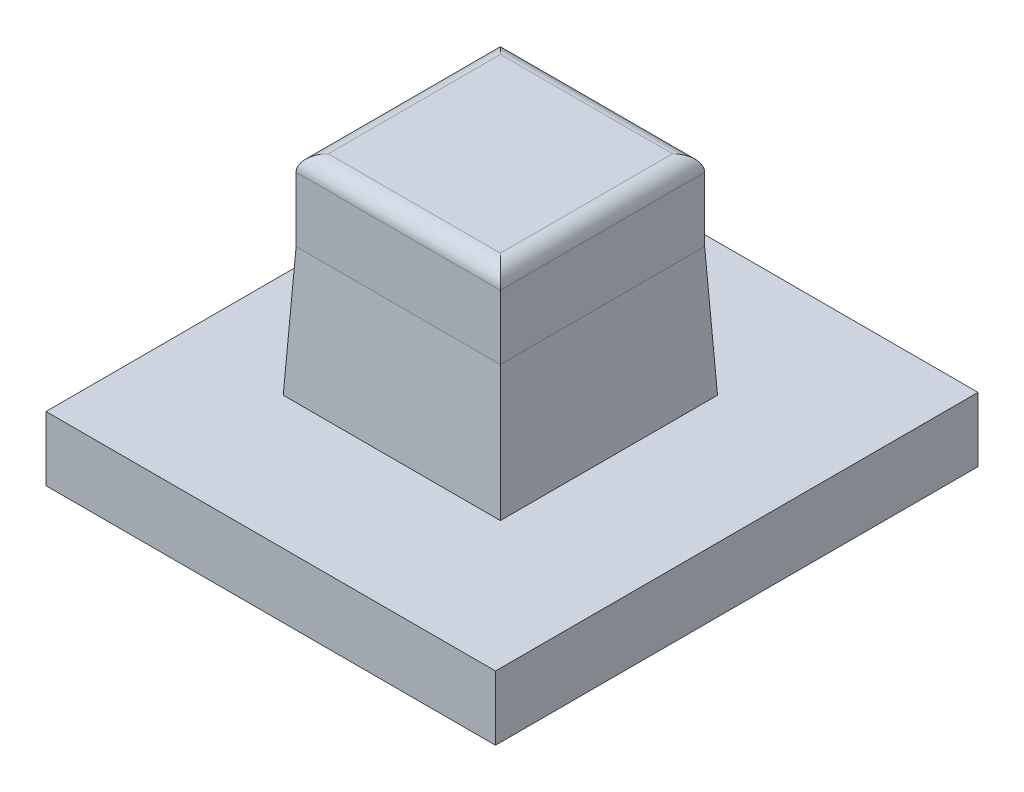
ISO-10303-21;
HEADER;
FILE_DESCRIPTION(('STEP AP214'),'2;1');
FILE_NAME('part.step','',(''),(''),'','','');
FILE_SCHEMA(('AUTOMOTIVE_DESIGN { 1 0 10303 214 1 1 1 1 }'));
ENDSEC;
DATA;
#1=APPLICATION_CONTEXT('core data for automotive mechanical design processes');
#2=APPLICATION_PROTOCOL_DEFINITION('international standard','automotive_design',2000,#1);
#3=PRODUCT_CONTEXT('',#1,'mechanical');
#4=PRODUCT('Part','Part','',(#3));
#5=PRODUCT_RELATED_PRODUCT_CATEGORY('part','',(#4));
#6=PRODUCT_DEFINITION_FORMATION('','',#4);
#7=PRODUCT_DEFINITION_CONTEXT('part definition',#1,'design');
#8=PRODUCT_DEFINITION('design','',#6,#7);
#9=PRODUCT_DEFINITION_SHAPE('','',#8);
#10=(LENGTH_UNIT() NAMED_UNIT(*) SI_UNIT(.MILLI.,.METRE.));
#11=(NAMED_UNIT(*) PLANE_ANGLE_UNIT() SI_UNIT($,.RADIAN.));
#12=(NAMED_UNIT(*) SI_UNIT($,.STERADIAN.) SOLID_ANGLE_UNIT());
#13=UNCERTAINTY_MEASURE_WITH_UNIT(LENGTH_MEASURE(1.E-05),#10,'distance_accuracy_value','');
#14=(GEOMETRIC_REPRESENTATION_CONTEXT(3) GLOBAL_UNCERTAINTY_ASSIGNED_CONTEXT((#13)) GLOBAL_UNIT_ASSIGNED_CONTEXT((#10,
#11,#12)) REPRESENTATION_CONTEXT('',''));
#15=CARTESIAN_POINT('',(0.,0.,0.));
#16=DIRECTION('',(0.,0.,1.));
#17=DIRECTION('',(1.,0.,0.));
#18=AXIS2_PLACEMENT_3D('',#15,#16,#17);
#19=CARTESIAN_POINT('',(0.,4.,0.));
#20=DIRECTION('',(0.,-1.,0.));
#21=DIRECTION('',(0.,0.,-1.));
#22=AXIS2_PLACEMENT_3D('',#19,#20,#21);
#23=PLANE('',#22);
#24=DIRECTION('',(1.,0.,0.));
#25=VECTOR('',#24,1.);
#26=CARTESIAN_POINT('',(0.,4.,-21.75));
#27=LINE('',#26,#25);
#28=CARTESIAN_POINT('',(6.5,4.,-21.75));
#29=VERTEX_POINT('',#28);
#30=CARTESIAN_POINT('',(20.,4.,-21.75));
#31=VERTEX_POINT('',#30);
#32=EDGE_CURVE('E237',#29,#31,#27,.T.);
#33=ORIENTED_EDGE('',*,*,#32,.T.);
#34=DIRECTION('',(0.,0.,1.));
#35=VECTOR('',#34,1.);
#36=CARTESIAN_POINT('',(20.,4.,0.));
#37=LINE('',#36,#35);
#38=CARTESIAN_POINT('',(20.,4.,-8.25));
#39=VERTEX_POINT('',#38);
#40=EDGE_CURVE('E240',#31,#39,#37,.T.);
#41=ORIENTED_EDGE('',*,*,#40,.T.);
#42=DIRECTION('',(-1.,0.,0.));
#43=VECTOR('',#42,1.);
#44=CARTESIAN_POINT('',(0.,4.,-8.25));
#45=LINE('',#44,#43);
#46=CARTESIAN_POINT('',(6.5,4.,-8.25));
#47=VERTEX_POINT('',#46);
#48=EDGE_CURVE('E231',#39,#47,#45,.T.);
#49=ORIENTED_EDGE('',*,*,#48,.T.);
#50=DIRECTION('',(0.,0.,-1.));
#51=VECTOR('',#50,1.);
#52=CARTESIAN_POINT('',(6.5,4.,0.));
#53=LINE('',#52,#51);
#54=EDGE_CURVE('E234',#47,#29,#53,.T.);
#55=ORIENTED_EDGE('',*,*,#54,.T.);
#56=EDGE_LOOP('',(#33,#41,#49,#55));
#57=FACE_BOUND('',#56,.T.);
#58=DIRECTION('',(1.,0.,0.));
#59=VECTOR('',#58,1.);
#60=CARTESIAN_POINT('',(0.,4.,0.));
#61=LINE('',#60,#59);
#62=CARTESIAN_POINT('',(0.,4.,0.));
#63=VERTEX_POINT('',#62);
#64=CARTESIAN_POINT('',(27.9456453711945,4.,0.));
#65=VERTEX_POINT('',#64);
#66=EDGE_CURVE('E296',#63,#65,#61,.T.);
#67=ORIENTED_EDGE('',*,*,#66,.T.);
#68=DIRECTION('',(0.,0.,-1.));
#69=VECTOR('',#68,1.);
#70=CARTESIAN_POINT('',(27.9456453711945,4.,0.));
#71=LINE('',#70,#69);
#72=CARTESIAN_POINT('',(27.9456453711945,4.,-30.));
#73=VERTEX_POINT('',#72);
#74=EDGE_CURVE('E142',#65,#73,#71,.T.);
#75=ORIENTED_EDGE('',*,*,#74,.T.);
#76=DIRECTION('',(-1.,0.,0.));
#77=VECTOR('',#76,1.);
#78=CARTESIAN_POINT('',(0.,4.,-30.));
#79=LINE('',#78,#77);
#80=CARTESIAN_POINT('',(0.,4.,-30.));
#81=VERTEX_POINT('',#80);
#82=EDGE_CURVE('E178',#73,#81,#79,.T.);
#83=ORIENTED_EDGE('',*,*,#82,.T.);
#84=DIRECTION('',(0.,0.,1.));
#85=VECTOR('',#84,1.);
#86=CARTESIAN_POINT('',(0.,4.,0.));
#87=LINE('',#86,#85);
#88=EDGE_CURVE('E168',#81,#63,#87,.T.);
#89=ORIENTED_EDGE('',*,*,#88,.T.);
#90=EDGE_LOOP('',(#67,#75,#83,#89));
#91=FACE_BOUND('',#90,.T.);
#92=ADVANCED_FACE('F45',(#57,#91),#23,.F.);
#93=CARTESIAN_POINT('',(0.,0.,0.));
#94=DIRECTION('',(0.,-1.,0.));
#95=DIRECTION('',(0.,0.,-1.));
#96=AXIS2_PLACEMENT_3D('',#93,#94,#95);
#97=PLANE('',#96);
#98=DIRECTION('',(0.,0.,1.));
#99=VECTOR('',#98,1.);
#100=CARTESIAN_POINT('',(27.9456453711945,0.,-58.4020531329729));
#101=LINE('',#100,#99);
#102=CARTESIAN_POINT('',(27.9456453711945,0.,-30.));
#103=VERTEX_POINT('',#102);
#104=CARTESIAN_POINT('',(27.9456453711945,0.,0.));
#105=VERTEX_POINT('',#104);
#106=EDGE_CURVE('E139',#103,#105,#101,.T.);
#107=ORIENTED_EDGE('',*,*,#106,.T.);
#108=DIRECTION('',(1.,0.,0.));
#109=VECTOR('',#108,1.);
#110=CARTESIAN_POINT('',(0.,0.,0.));
#111=LINE('',#110,#109);
#112=CARTESIAN_POINT('',(0.,0.,0.));
#113=VERTEX_POINT('',#112);
#114=EDGE_CURVE('E153',#113,#105,#111,.T.);
#115=ORIENTED_EDGE('',*,*,#114,.F.);
#116=DIRECTION('',(0.,0.,1.));
#117=VECTOR('',#116,1.);
#118=CARTESIAN_POINT('',(0.,0.,0.));
#119=LINE('',#118,#117);
#120=CARTESIAN_POINT('',(0.,0.,-30.));
#121=VERTEX_POINT('',#120);
#122=EDGE_CURVE('E164',#121,#113,#119,.T.);
#123=ORIENTED_EDGE('',*,*,#122,.F.);
#124=DIRECTION('',(-1.,0.,0.));
#125=VECTOR('',#124,1.);
#126=CARTESIAN_POINT('',(0.,0.,-30.));
#127=LINE('',#126,#125);
#128=EDGE_CURVE('E155',#103,#121,#127,.T.);
#129=ORIENTED_EDGE('',*,*,#128,.F.);
#130=EDGE_LOOP('',(#107,#115,#123,#129));
#131=FACE_BOUND('',#130,.T.);
#132=ADVANCED_FACE('F151',(#131),#97,.T.);
#133=CARTESIAN_POINT('',(0.,4.,0.));
#134=DIRECTION('',(1.,0.,0.));
#135=DIRECTION('',(0.,0.,-1.));
#136=AXIS2_PLACEMENT_3D('',#133,#134,#135);
#137=PLANE('',#136);
#138=ORIENTED_EDGE('',*,*,#122,.T.);
#139=DIRECTION('',(0.,-1.,0.));
#140=VECTOR('',#139,1.);
#141=CARTESIAN_POINT('',(0.,4.,0.));
#142=LINE('',#141,#140);
#143=EDGE_CURVE('E161',#63,#113,#142,.T.);
#144=ORIENTED_EDGE('',*,*,#143,.F.);
#145=ORIENTED_EDGE('',*,*,#88,.F.);
#146=DIRECTION('',(0.,-1.,0.));
#147=VECTOR('',#146,1.);
#148=CARTESIAN_POINT('',(0.,4.,-30.));
#149=LINE('',#148,#147);
#150=EDGE_CURVE('E174',#81,#121,#149,.T.);
#151=ORIENTED_EDGE('',*,*,#150,.T.);
#152=EDGE_LOOP('',(#138,#144,#145,#151));
#153=FACE_BOUND('',#152,.T.);
#154=ADVANCED_FACE('F305',(#153),#137,.F.);
#155=CARTESIAN_POINT('',(0.,4.,0.));
#156=DIRECTION('',(0.,0.,-1.));
#157=DIRECTION('',(-1.,0.,0.));
#158=AXIS2_PLACEMENT_3D('',#155,#156,#157);
#159=PLANE('',#158);
#160=ORIENTED_EDGE('',*,*,#114,.T.);
#161=DIRECTION('',(0.,1.,0.));
#162=VECTOR('',#161,1.);
#163=CARTESIAN_POINT('',(27.9456453711945,4.,0.));
#164=LINE('',#163,#162);
#165=EDGE_CURVE('E136',#105,#65,#164,.T.);
#166=ORIENTED_EDGE('',*,*,#165,.T.);
#167=ORIENTED_EDGE('',*,*,#66,.F.);
#168=ORIENTED_EDGE('',*,*,#143,.T.);
#169=EDGE_LOOP('',(#160,#166,#167,#168));
#170=FACE_BOUND('',#169,.T.);
#171=ADVANCED_FACE('F159',(#170),#159,.F.);
#172=CARTESIAN_POINT('',(0.,4.,-30.));
#173=DIRECTION('',(0.,0.,1.));
#174=DIRECTION('',(1.,0.,0.));
#175=AXIS2_PLACEMENT_3D('',#172,#173,#174);
#176=PLANE('',#175);
#177=ORIENTED_EDGE('',*,*,#82,.F.);
#178=DIRECTION('',(0.,-1.,0.));
#179=VECTOR('',#178,1.);
#180=CARTESIAN_POINT('',(27.9456453711945,4.,-30.));
#181=LINE('',#180,#179);
#182=EDGE_CURVE('E181',#73,#103,#181,.T.);
#183=ORIENTED_EDGE('',*,*,#182,.T.);
#184=ORIENTED_EDGE('',*,*,#128,.T.);
#185=ORIENTED_EDGE('',*,*,#150,.F.);
#186=EDGE_LOOP('',(#177,#183,#184,#185));
#187=FACE_BOUND('',#186,.T.);
#188=ADVANCED_FACE('F303',(#187),#176,.F.);
#189=CARTESIAN_POINT('',(6.9,-17.9605122421383,-8.65));
#190=DIRECTION('',(0.,0.,1.));
#191=DIRECTION('',(1.,0.,0.));
#192=AXIS2_PLACEMENT_3D('',#189,#190,#191);
#193=PLANE('',#192);
#194=DIRECTION('',(0.,1.,0.));
#195=VECTOR('',#194,1.);
#196=CARTESIAN_POINT('',(6.9,-17.9605122421383,-8.65));
#197=LINE('',#196,#195);
#198=CARTESIAN_POINT('',(6.9,11.9999999999994,-8.65));
#199=VERTEX_POINT('',#198);
#200=CARTESIAN_POINT('',(6.9,16.,-8.65));
#201=VERTEX_POINT('',#200);
#202=EDGE_CURVE('E170',#199,#201,#197,.T.);
#203=ORIENTED_EDGE('',*,*,#202,.F.);
#204=DIRECTION('',(1.,0.,0.));
#205=VECTOR('',#204,1.);
#206=CARTESIAN_POINT('',(6.9,11.9999999999994,-8.65));
#207=LINE('',#206,#205);
#208=CARTESIAN_POINT('',(19.6,11.9999999999994,-8.65));
#209=VERTEX_POINT('',#208);
#210=EDGE_CURVE('E11',#199,#209,#207,.T.);
#211=ORIENTED_EDGE('',*,*,#210,.T.);
#212=DIRECTION('',(0.,1.,0.));
#213=VECTOR('',#212,1.);
#214=CARTESIAN_POINT('',(19.6,-17.9605122421383,-8.65));
#215=LINE('',#214,#213);
#216=CARTESIAN_POINT('',(19.6,16.,-8.65));
#217=VERTEX_POINT('',#216);
#218=EDGE_CURVE('E147',#209,#217,#215,.T.);
#219=ORIENTED_EDGE('',*,*,#218,.T.);
#220=DIRECTION('',(1.,0.,0.));
#221=VECTOR('',#220,1.);
#222=CARTESIAN_POINT('',(6.9,16.,-8.65));
#223=LINE('',#222,#221);
#224=EDGE_CURVE('E205',#217,#201,#223,.F.);
#225=ORIENTED_EDGE('',*,*,#224,.T.);
#226=EDGE_LOOP('',(#203,#211,#219,#225));
#227=FACE_BOUND('',#226,.T.);
#228=ADVANCED_FACE('F320',(#227),#193,.T.);
#229=CARTESIAN_POINT('',(6.9,-17.9605122421383,-21.35));
#230=DIRECTION('',(0.,0.,-1.));
#231=DIRECTION('',(-1.,0.,0.));
#232=AXIS2_PLACEMENT_3D('',#229,#230,#231);
#233=PLANE('',#232);
#234=DIRECTION('',(0.,1.,0.));
#235=VECTOR('',#234,1.);
#236=CARTESIAN_POINT('',(19.6,-17.9605122421383,-21.35));
#237=LINE('',#236,#235);
#238=CARTESIAN_POINT('',(19.6,11.9999999999994,-21.35));
#239=VERTEX_POINT('',#238);
#240=CARTESIAN_POINT('',(19.6,16.,-21.35));
#241=VERTEX_POINT('',#240);
#242=EDGE_CURVE('E280',#239,#241,#237,.T.);
#243=ORIENTED_EDGE('',*,*,#242,.F.);
#244=DIRECTION('',(-1.,0.,0.));
#245=VECTOR('',#244,1.);
#246=CARTESIAN_POINT('',(6.9,11.9999999999994,-21.35));
#247=LINE('',#246,#245);
#248=CARTESIAN_POINT('',(6.9,11.9999999999994,-21.35));
#249=VERTEX_POINT('',#248);
#250=EDGE_CURVE('E71',#239,#249,#247,.T.);
#251=ORIENTED_EDGE('',*,*,#250,.T.);
#252=DIRECTION('',(0.,1.,0.));
#253=VECTOR('',#252,1.);
#254=CARTESIAN_POINT('',(6.9,-17.9605122421383,-21.35));
#255=LINE('',#254,#253);
#256=CARTESIAN_POINT('',(6.9,16.,-21.35));
#257=VERTEX_POINT('',#256);
#258=EDGE_CURVE('E284',#249,#257,#255,.T.);
#259=ORIENTED_EDGE('',*,*,#258,.T.);
#260=DIRECTION('',(-1.,0.,0.));
#261=VECTOR('',#260,1.);
#262=CARTESIAN_POINT('',(6.9,16.,-21.35));
#263=LINE('',#262,#261);
#264=EDGE_CURVE('E197',#257,#241,#263,.F.);
#265=ORIENTED_EDGE('',*,*,#264,.T.);
#266=EDGE_LOOP('',(#243,#251,#259,#265));
#267=FACE_BOUND('',#266,.T.);
#268=ADVANCED_FACE('F281',(#267),#233,.T.);
#269=CARTESIAN_POINT('',(19.6,-17.9605122421383,-21.35));
#270=DIRECTION('',(1.,0.,0.));
#271=DIRECTION('',(0.,0.,-1.));
#272=AXIS2_PLACEMENT_3D('',#269,#270,#271);
#273=PLANE('',#272);
#274=ORIENTED_EDGE('',*,*,#218,.F.);
#275=DIRECTION('',(0.,0.,-1.));
#276=VECTOR('',#275,1.);
#277=CARTESIAN_POINT('',(19.6,11.9999999999994,-21.35));
#278=LINE('',#277,#276);
#279=EDGE_CURVE('E213',#209,#239,#278,.T.);
#280=ORIENTED_EDGE('',*,*,#279,.T.);
#281=ORIENTED_EDGE('',*,*,#242,.T.);
#282=DIRECTION('',(0.,0.,-1.));
#283=VECTOR('',#282,1.);
#284=CARTESIAN_POINT('',(19.6,16.,-21.35));
#285=LINE('',#284,#283);
#286=EDGE_CURVE('E201',#241,#217,#285,.F.);
#287=ORIENTED_EDGE('',*,*,#286,.T.);
#288=EDGE_LOOP('',(#274,#280,#281,#287));
#289=FACE_BOUND('',#288,.T.);
#290=ADVANCED_FACE('F279',(#289),#273,.T.);
#291=CARTESIAN_POINT('',(6.9,-17.9605122421383,-21.35));
#292=DIRECTION('',(-1.,0.,0.));
#293=DIRECTION('',(0.,0.,1.));
#294=AXIS2_PLACEMENT_3D('',#291,#292,#293);
#295=PLANE('',#294);
#296=ORIENTED_EDGE('',*,*,#258,.F.);
#297=DIRECTION('',(0.,0.,1.));
#298=VECTOR('',#297,1.);
#299=CARTESIAN_POINT('',(6.9,11.9999999999994,-21.35));
#300=LINE('',#299,#298);
#301=EDGE_CURVE('E56',#249,#199,#300,.T.);
#302=ORIENTED_EDGE('',*,*,#301,.T.);
#303=ORIENTED_EDGE('',*,*,#202,.T.);
#304=DIRECTION('',(0.,0.,1.));
#305=VECTOR('',#304,1.);
#306=CARTESIAN_POINT('',(6.9,16.,-21.35));
#307=LINE('',#306,#305);
#308=EDGE_CURVE('E209',#201,#257,#307,.F.);
#309=ORIENTED_EDGE('',*,*,#308,.T.);
#310=EDGE_LOOP('',(#296,#302,#303,#309));
#311=FACE_BOUND('',#310,.T.);
#312=ADVANCED_FACE('F334',(#311),#295,.T.);
#313=CARTESIAN_POINT('',(0.,17.,0.));
#314=DIRECTION('',(0.,1.,0.));
#315=DIRECTION('',(0.,0.,1.));
#316=AXIS2_PLACEMENT_3D('',#313,#314,#315);
#317=PLANE('',#316);
#318=DIRECTION('',(0.,0.,-1.));
#319=VECTOR('',#318,1.);
#320=CARTESIAN_POINT('',(18.6,17.,0.));
#321=LINE('',#320,#319);
#322=CARTESIAN_POINT('',(18.6,17.,-9.65));
#323=VERTEX_POINT('',#322);
#324=CARTESIAN_POINT('',(18.6,17.,-20.35));
#325=VERTEX_POINT('',#324);
#326=EDGE_CURVE('E190',#323,#325,#321,.T.);
#327=ORIENTED_EDGE('',*,*,#326,.T.);
#328=DIRECTION('',(-1.,0.,0.));
#329=VECTOR('',#328,1.);
#330=CARTESIAN_POINT('',(0.,17.,-20.35));
#331=LINE('',#330,#329);
#332=CARTESIAN_POINT('',(7.89999999999999,17.,-20.35));
#333=VERTEX_POINT('',#332);
#334=EDGE_CURVE('E193',#325,#333,#331,.T.);
#335=ORIENTED_EDGE('',*,*,#334,.T.);
#336=DIRECTION('',(0.,0.,1.));
#337=VECTOR('',#336,1.);
#338=CARTESIAN_POINT('',(7.9,17.,0.));
#339=LINE('',#338,#337);
#340=CARTESIAN_POINT('',(7.9,17.,-9.65));
#341=VERTEX_POINT('',#340);
#342=EDGE_CURVE('E184',#333,#341,#339,.T.);
#343=ORIENTED_EDGE('',*,*,#342,.T.);
#344=DIRECTION('',(1.,0.,0.));
#345=VECTOR('',#344,1.);
#346=CARTESIAN_POINT('',(0.,17.,-9.65));
#347=LINE('',#346,#345);
#348=EDGE_CURVE('E187',#341,#323,#347,.T.);
#349=ORIENTED_EDGE('',*,*,#348,.T.);
#350=EDGE_LOOP('',(#327,#335,#343,#349));
#351=FACE_BOUND('',#350,.T.);
#352=ADVANCED_FACE('F347',(#351),#317,.T.);
#353=CARTESIAN_POINT('',(27.9456453711945,0.,-58.4020531329729));
#354=DIRECTION('',(-1.,0.,0.));
#355=DIRECTION('',(0.,0.,1.));
#356=AXIS2_PLACEMENT_3D('',#353,#354,#355);
#357=PLANE('',#356);
#358=ORIENTED_EDGE('',*,*,#106,.F.);
#359=ORIENTED_EDGE('',*,*,#182,.F.);
#360=ORIENTED_EDGE('',*,*,#74,.F.);
#361=ORIENTED_EDGE('',*,*,#165,.F.);
#362=EDGE_LOOP('',(#358,#359,#360,#361));
#363=FACE_BOUND('',#362,.T.);
#364=ADVANCED_FACE('F138',(#363),#357,.F.);
#365=CARTESIAN_POINT('',(0.,16.,-9.65));
#366=DIRECTION('',(1.,0.,0.));
#367=DIRECTION('',(0.,0.,-1.));
#368=AXIS2_PLACEMENT_3D('',#365,#366,#367);
#369=CYLINDRICAL_SURFACE('',#368,1.);
#370=CARTESIAN_POINT('',(7.9,16.,-9.65));
#371=DIRECTION('',(0.707106781186548,0.,0.707106781186547));
#372=DIRECTION('',(-0.707106781186547,0.,0.707106781186548));
#373=AXIS2_PLACEMENT_3D('',#370,#371,#372);
#374=ELLIPSE('',#373,1.41421356237309,1.);
#375=EDGE_CURVE('E221',#201,#341,#374,.F.);
#376=ORIENTED_EDGE('',*,*,#375,.F.);
#377=ORIENTED_EDGE('',*,*,#224,.F.);
#378=CARTESIAN_POINT('',(18.6,16.,-9.65));
#379=DIRECTION('',(0.707106781186547,0.,-0.707106781186547));
#380=DIRECTION('',(0.707106781186547,0.,0.707106781186547));
#381=AXIS2_PLACEMENT_3D('',#378,#379,#380);
#382=ELLIPSE('',#381,1.41421356237309,1.);
#383=EDGE_CURVE('E157',#323,#217,#382,.T.);
#384=ORIENTED_EDGE('',*,*,#383,.F.);
#385=ORIENTED_EDGE('',*,*,#348,.F.);
#386=EDGE_LOOP('',(#376,#377,#384,#385));
#387=FACE_BOUND('',#386,.T.);
#388=ADVANCED_FACE('F353',(#387),#369,.T.);
#389=CARTESIAN_POINT('',(18.6,16.,0.));
#390=DIRECTION('',(0.,0.,-1.));
#391=DIRECTION('',(-1.,0.,0.));
#392=AXIS2_PLACEMENT_3D('',#389,#390,#391);
#393=CYLINDRICAL_SURFACE('',#392,1.);
#394=ORIENTED_EDGE('',*,*,#383,.T.);
#395=ORIENTED_EDGE('',*,*,#286,.F.);
#396=CARTESIAN_POINT('',(18.6,16.,-20.35));
#397=DIRECTION('',(-0.707106781186547,0.,-0.707106781186547));
#398=DIRECTION('',(0.707106781186547,0.,-0.707106781186547));
#399=AXIS2_PLACEMENT_3D('',#396,#397,#398);
#400=ELLIPSE('',#399,1.41421356237309,1.);
#401=EDGE_CURVE('E217',#325,#241,#400,.T.);
#402=ORIENTED_EDGE('',*,*,#401,.F.);
#403=ORIENTED_EDGE('',*,*,#326,.F.);
#404=EDGE_LOOP('',(#394,#395,#402,#403));
#405=FACE_BOUND('',#404,.T.);
#406=ADVANCED_FACE('F351',(#405),#393,.T.);
#407=CARTESIAN_POINT('',(7.9,16.,0.));
#408=DIRECTION('',(0.,0.,1.));
#409=DIRECTION('',(1.,0.,0.));
#410=AXIS2_PLACEMENT_3D('',#407,#408,#409);
#411=CYLINDRICAL_SURFACE('',#410,1.);
#412=ORIENTED_EDGE('',*,*,#375,.T.);
#413=ORIENTED_EDGE('',*,*,#342,.F.);
#414=CARTESIAN_POINT('',(7.89999999999999,16.,-20.35));
#415=DIRECTION('',(-0.707106781186547,0.,0.707106781186548));
#416=DIRECTION('',(0.707106781186548,0.,0.707106781186547));
#417=AXIS2_PLACEMENT_3D('',#414,#415,#416);
#418=ELLIPSE('',#417,1.4142135623731,1.);
#419=EDGE_CURVE('E214',#257,#333,#418,.F.);
#420=ORIENTED_EDGE('',*,*,#419,.F.);
#421=ORIENTED_EDGE('',*,*,#308,.F.);
#422=EDGE_LOOP('',(#412,#413,#420,#421));
#423=FACE_BOUND('',#422,.T.);
#424=ADVANCED_FACE('F344',(#423),#411,.T.);
#425=CARTESIAN_POINT('',(0.,16.,-20.35));
#426=DIRECTION('',(-1.,0.,0.));
#427=DIRECTION('',(0.,0.,1.));
#428=AXIS2_PLACEMENT_3D('',#425,#426,#427);
#429=CYLINDRICAL_SURFACE('',#428,1.);
#430=ORIENTED_EDGE('',*,*,#401,.T.);
#431=ORIENTED_EDGE('',*,*,#264,.F.);
#432=ORIENTED_EDGE('',*,*,#419,.T.);
#433=ORIENTED_EDGE('',*,*,#334,.F.);
#434=EDGE_LOOP('',(#430,#431,#432,#433));
#435=FACE_BOUND('',#434,.T.);
#436=ADVANCED_FACE('F339',(#435),#429,.T.);
#437=CARTESIAN_POINT('',(6.9,11.9999999999994,-21.35));
#438=DIRECTION('',(0.998752338877844,-0.0499376169438956,0.));
#439=DIRECTION('',(0.,0.,1.));
#440=AXIS2_PLACEMENT_3D('',#437,#438,#439);
#441=PLANE('',#440);
#442=DIRECTION('',(-0.0498754668053851,-0.997509336107633,-0.0498754668053848));
#443=VECTOR('',#442,1.);
#444=CARTESIAN_POINT('',(6.9,11.9999999999994,-21.35));
#445=LINE('',#444,#443);
#446=EDGE_CURVE('E253',#29,#249,#445,.F.);
#447=ORIENTED_EDGE('',*,*,#446,.F.);
#448=ORIENTED_EDGE('',*,*,#54,.F.);
#449=DIRECTION('',(-0.0498754668053851,-0.997509336107633,0.049875466805385));
#450=VECTOR('',#449,1.);
#451=CARTESIAN_POINT('',(6.9,11.9999999999994,-8.65));
#452=LINE('',#451,#450);
#453=EDGE_CURVE('E50',#199,#47,#452,.T.);
#454=ORIENTED_EDGE('',*,*,#453,.F.);
#455=ORIENTED_EDGE('',*,*,#301,.F.);
#456=EDGE_LOOP('',(#447,#448,#454,#455));
#457=FACE_BOUND('',#456,.T.);
#458=ADVANCED_FACE('F48',(#457),#441,.F.);
#459=CARTESIAN_POINT('',(6.9,11.9999999999994,-8.65));
#460=DIRECTION('',(0.,-0.0499376169438956,-0.998752338877844));
#461=DIRECTION('',(1.,0.,0.));
#462=AXIS2_PLACEMENT_3D('',#459,#460,#461);
#463=PLANE('',#462);
#464=ORIENTED_EDGE('',*,*,#453,.T.);
#465=ORIENTED_EDGE('',*,*,#48,.F.);
#466=DIRECTION('',(-0.0498754668053848,0.997509336107633,-0.049875466805385));
#467=VECTOR('',#466,1.);
#468=CARTESIAN_POINT('',(19.568407960199,12.6318407960194,-8.681592039801));
#469=LINE('',#468,#467);
#470=EDGE_CURVE('E251',#209,#39,#469,.F.);
#471=ORIENTED_EDGE('',*,*,#470,.F.);
#472=ORIENTED_EDGE('',*,*,#210,.F.);
#473=EDGE_LOOP('',(#464,#465,#471,#472));
#474=FACE_BOUND('',#473,.T.);
#475=ADVANCED_FACE('F265',(#474),#463,.F.);
#476=CARTESIAN_POINT('',(6.9,11.9999999999994,-21.35));
#477=DIRECTION('',(0.,-0.0499376169438954,0.998752338877844));
#478=DIRECTION('',(-1.,0.,0.));
#479=AXIS2_PLACEMENT_3D('',#476,#477,#478);
#480=PLANE('',#479);
#481=ORIENTED_EDGE('',*,*,#446,.T.);
#482=ORIENTED_EDGE('',*,*,#250,.F.);
#483=DIRECTION('',(0.0498754668053848,-0.997509336107633,-0.0498754668053848));
#484=VECTOR('',#483,1.);
#485=CARTESIAN_POINT('',(19.568407960199,12.6318407960194,-21.318407960199));
#486=LINE('',#485,#484);
#487=EDGE_CURVE('E248',#31,#239,#486,.F.);
#488=ORIENTED_EDGE('',*,*,#487,.F.);
#489=ORIENTED_EDGE('',*,*,#32,.F.);
#490=EDGE_LOOP('',(#481,#482,#488,#489));
#491=FACE_BOUND('',#490,.T.);
#492=ADVANCED_FACE('F276',(#491),#480,.F.);
#493=CARTESIAN_POINT('',(19.6,11.9999999999994,-21.35));
#494=DIRECTION('',(-0.998752338877844,-0.0499376169438954,0.));
#495=DIRECTION('',(0.,0.,-1.));
#496=AXIS2_PLACEMENT_3D('',#493,#494,#495);
#497=PLANE('',#496);
#498=ORIENTED_EDGE('',*,*,#470,.T.);
#499=ORIENTED_EDGE('',*,*,#40,.F.);
#500=ORIENTED_EDGE('',*,*,#487,.T.);
#501=ORIENTED_EDGE('',*,*,#279,.F.);
#502=EDGE_LOOP('',(#498,#499,#500,#501));
#503=FACE_BOUND('',#502,.T.);
#504=ADVANCED_FACE('F274',(#503),#497,.F.);
#505=CLOSED_SHELL('',(#92,#132,#154,#171,#188,#228,#268,#290,#312,#352,#364,#388,#406,#424,#436,
#458,#475,#492,#504));
#506=MANIFOLD_SOLID_BREP('B2',#505);
#507=ADVANCED_BREP_SHAPE_REPRESENTATION('',(#18,#506),#14);
#508=SHAPE_DEFINITION_REPRESENTATION(#9,#507);
ENDSEC;
END-ISO-10303-21;
